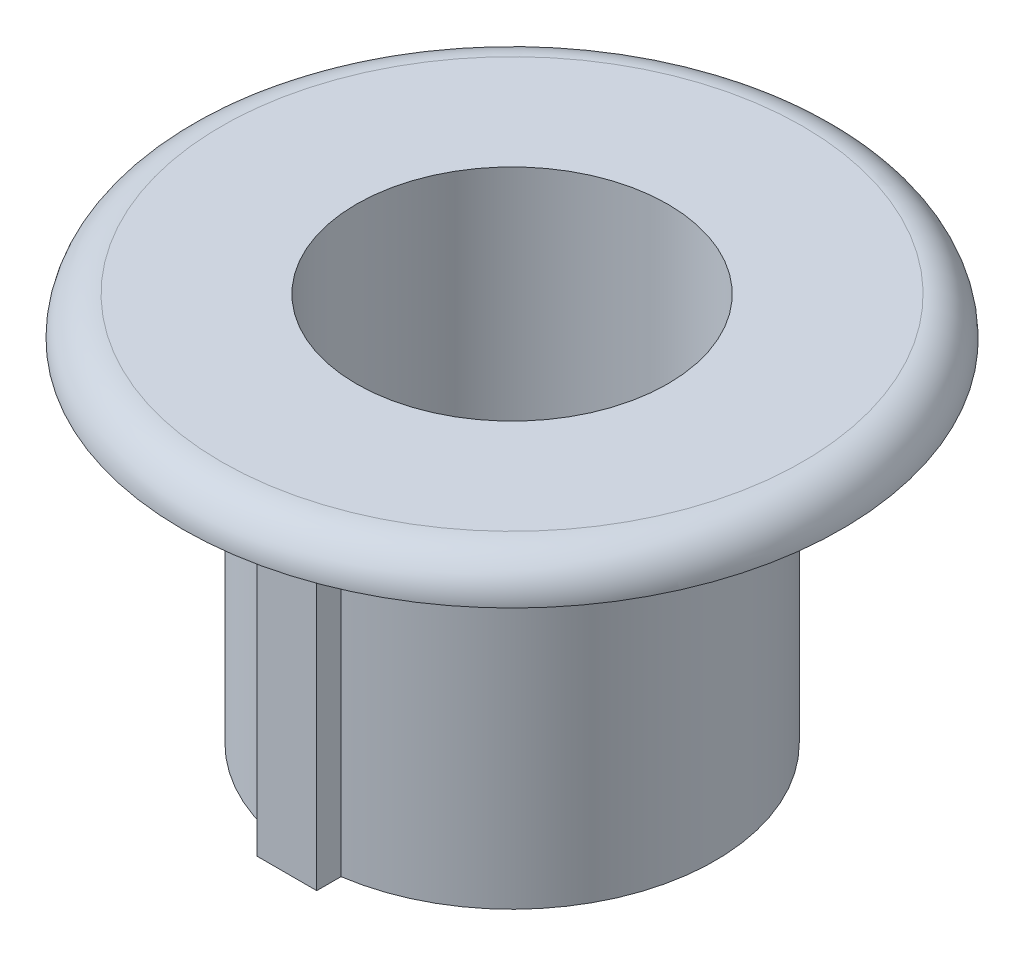
ISO-10303-21;
HEADER;
FILE_DESCRIPTION(('STEP AP214'),'2;1');
FILE_NAME('part.step','',(''),(''),'','','');
FILE_SCHEMA(('AUTOMOTIVE_DESIGN { 1 0 10303 214 1 1 1 1 }'));
ENDSEC;
DATA;
#1=APPLICATION_CONTEXT('core data for automotive mechanical design processes');
#2=APPLICATION_PROTOCOL_DEFINITION('international standard','automotive_design',2000,#1);
#3=PRODUCT_CONTEXT('',#1,'mechanical');
#4=PRODUCT('Part','Part','',(#3));
#5=PRODUCT_RELATED_PRODUCT_CATEGORY('part','',(#4));
#6=PRODUCT_DEFINITION_FORMATION('','',#4);
#7=PRODUCT_DEFINITION_CONTEXT('part definition',#1,'design');
#8=PRODUCT_DEFINITION('design','',#6,#7);
#9=PRODUCT_DEFINITION_SHAPE('','',#8);
#10=(LENGTH_UNIT() NAMED_UNIT(*) SI_UNIT(.MILLI.,.METRE.));
#11=(NAMED_UNIT(*) PLANE_ANGLE_UNIT() SI_UNIT($,.RADIAN.));
#12=(NAMED_UNIT(*) SI_UNIT($,.STERADIAN.) SOLID_ANGLE_UNIT());
#13=UNCERTAINTY_MEASURE_WITH_UNIT(LENGTH_MEASURE(1.E-05),#10,'distance_accuracy_value','');
#14=(GEOMETRIC_REPRESENTATION_CONTEXT(3) GLOBAL_UNCERTAINTY_ASSIGNED_CONTEXT((#13)) GLOBAL_UNIT_ASSIGNED_CONTEXT((#10,
#11,#12)) REPRESENTATION_CONTEXT('',''));
#15=CARTESIAN_POINT('',(0.,0.,0.));
#16=DIRECTION('',(0.,0.,1.));
#17=DIRECTION('',(1.,0.,0.));
#18=AXIS2_PLACEMENT_3D('',#15,#16,#17);
#19=CARTESIAN_POINT('',(9.6266,40.9103228367056,0.));
#20=DIRECTION('',(0.,-1.,0.));
#21=DIRECTION('',(0.,0.,-1.));
#22=AXIS2_PLACEMENT_3D('',#19,#20,#21);
#23=PLANE('',#22);
#24=CARTESIAN_POINT('',(0.,40.9103228367056,0.));
#25=DIRECTION('',(0.,1.,0.));
#26=DIRECTION('',(0.,0.,1.));
#27=AXIS2_PLACEMENT_3D('',#24,#25,#26);
#28=CIRCLE('',#27,9.6266);
#29=CARTESIAN_POINT('',(0.,40.9103228367056,9.6266));
#30=VERTEX_POINT('',#29);
#31=EDGE_CURVE('E130',#30,#30,#28,.T.);
#32=ORIENTED_EDGE('',*,*,#31,.F.);
#33=EDGE_LOOP('',(#32));
#34=FACE_BOUND('',#33,.T.);
#35=DIRECTION('',(-1.,0.,0.));
#36=VECTOR('',#35,1.);
#37=CARTESIAN_POINT('',(-1.16654141252412,40.9103228367056,8.8138));
#38=LINE('',#37,#36);
#39=CARTESIAN_POINT('',(1.16654141252412,40.9103228367056,8.8138));
#40=VERTEX_POINT('',#39);
#41=CARTESIAN_POINT('',(-1.16654141252412,40.9103228367056,8.8138));
#42=VERTEX_POINT('',#41);
#43=EDGE_CURVE('E58',#40,#42,#38,.T.);
#44=ORIENTED_EDGE('',*,*,#43,.F.);
#45=DIRECTION('',(0.,0.,1.));
#46=VECTOR('',#45,1.);
#47=CARTESIAN_POINT('',(1.16654141252412,40.9103228367056,8.8138));
#48=LINE('',#47,#46);
#49=CARTESIAN_POINT('',(1.16654141252412,40.9103228367056,7.86415037832226));
#50=VERTEX_POINT('',#49);
#51=EDGE_CURVE('E111',#50,#40,#48,.T.);
#52=ORIENTED_EDGE('',*,*,#51,.F.);
#53=CARTESIAN_POINT('',(0.,40.9103228367056,0.));
#54=DIRECTION('',(0.,1.,0.));
#55=DIRECTION('',(0.,0.,1.));
#56=AXIS2_PLACEMENT_3D('',#53,#54,#55);
#57=CIRCLE('',#56,7.9502);
#58=CARTESIAN_POINT('',(-1.16654141252412,40.9103228367056,7.86415037832226));
#59=VERTEX_POINT('',#58);
#60=EDGE_CURVE('E128',#50,#59,#57,.T.);
#61=ORIENTED_EDGE('',*,*,#60,.T.);
#62=DIRECTION('',(0.,0.,-1.));
#63=VECTOR('',#62,1.);
#64=CARTESIAN_POINT('',(-1.16654141252412,40.9103228367056,7.86415037832226));
#65=LINE('',#64,#63);
#66=EDGE_CURVE('E63',#42,#59,#65,.T.);
#67=ORIENTED_EDGE('',*,*,#66,.F.);
#68=EDGE_LOOP('',(#44,#52,#61,#67));
#69=FACE_BOUND('',#68,.T.);
#70=ADVANCED_FACE('F43',(#34,#69),#23,.T.);
#71=CARTESIAN_POINT('',(0.,42.4343228367056,0.));
#72=DIRECTION('',(0.,1.,0.));
#73=DIRECTION('',(0.,0.,1.));
#74=AXIS2_PLACEMENT_3D('',#71,#72,#73);
#75=CYLINDRICAL_SURFACE('',#74,7.9502);
#76=ORIENTED_EDGE('',*,*,#60,.F.);
#77=DIRECTION('',(0.,-1.,0.));
#78=VECTOR('',#77,1.);
#79=CARTESIAN_POINT('',(1.16654141252412,43.4292729895447,7.86415037832226));
#80=LINE('',#79,#78);
#81=CARTESIAN_POINT('',(1.16654141252412,27.1943228367056,7.86415037832226));
#82=VERTEX_POINT('',#81);
#83=EDGE_CURVE('E103',#50,#82,#80,.T.);
#84=ORIENTED_EDGE('',*,*,#83,.T.);
#85=CARTESIAN_POINT('',(0.,27.1943228367056,0.));
#86=DIRECTION('',(0.,1.,0.));
#87=DIRECTION('',(0.,0.,1.));
#88=AXIS2_PLACEMENT_3D('',#85,#86,#87);
#89=CIRCLE('',#88,7.9502);
#90=CARTESIAN_POINT('',(-1.16654141252412,27.1943228367056,7.86415037832226));
#91=VERTEX_POINT('',#90);
#92=EDGE_CURVE('E126',#82,#91,#89,.T.);
#93=ORIENTED_EDGE('',*,*,#92,.T.);
#94=DIRECTION('',(0.,-1.,0.));
#95=VECTOR('',#94,1.);
#96=CARTESIAN_POINT('',(-1.16654141252412,43.4292729895447,7.86415037832226));
#97=LINE('',#96,#95);
#98=EDGE_CURVE('E90',#59,#91,#97,.T.);
#99=ORIENTED_EDGE('',*,*,#98,.F.);
#100=EDGE_LOOP('',(#76,#84,#93,#99));
#101=FACE_BOUND('',#100,.T.);
#102=ADVANCED_FACE('F152',(#101),#75,.T.);
#103=CARTESIAN_POINT('',(0.,42.4343228367056,0.));
#104=DIRECTION('',(0.,1.,0.));
#105=DIRECTION('',(0.,0.,1.));
#106=AXIS2_PLACEMENT_3D('',#103,#104,#105);
#107=CYLINDRICAL_SURFACE('',#106,10.414);
#108=CARTESIAN_POINT('',(0.,39.3863228367056,0.));
#109=DIRECTION('',(0.,1.,0.));
#110=DIRECTION('',(0.,0.,1.));
#111=AXIS2_PLACEMENT_3D('',#108,#109,#110);
#112=CIRCLE('',#111,10.414);
#113=CARTESIAN_POINT('',(0.,39.3863228367056,10.414));
#114=VERTEX_POINT('',#113);
#115=EDGE_CURVE('E51',#114,#114,#112,.T.);
#116=ORIENTED_EDGE('',*,*,#115,.T.);
#117=EDGE_LOOP('',(#116));
#118=FACE_BOUND('',#117,.T.);
#119=CARTESIAN_POINT('',(0.,40.9103228367056,0.));
#120=DIRECTION('',(0.,1.,0.));
#121=DIRECTION('',(0.,0.,1.));
#122=AXIS2_PLACEMENT_3D('',#119,#120,#121);
#123=CIRCLE('',#122,10.414);
#124=CARTESIAN_POINT('',(0.,40.9103228367056,10.414));
#125=VERTEX_POINT('',#124);
#126=EDGE_CURVE('E114',#125,#125,#123,.T.);
#127=ORIENTED_EDGE('',*,*,#126,.F.);
#128=EDGE_LOOP('',(#127));
#129=FACE_BOUND('',#128,.T.);
#130=ADVANCED_FACE('F138',(#118,#129),#107,.T.);
#131=CARTESIAN_POINT('',(10.414,39.3863228367056,0.));
#132=DIRECTION('',(0.,-1.,0.));
#133=DIRECTION('',(0.,0.,-1.));
#134=AXIS2_PLACEMENT_3D('',#131,#132,#133);
#135=PLANE('',#134);
#136=CARTESIAN_POINT('',(0.,39.3863228367056,0.));
#137=DIRECTION('',(0.,1.,0.));
#138=DIRECTION('',(0.,0.,1.));
#139=AXIS2_PLACEMENT_3D('',#136,#137,#138);
#140=CIRCLE('',#139,9.6266);
#141=CARTESIAN_POINT('',(0.,39.3863228367056,9.6266));
#142=VERTEX_POINT('',#141);
#143=EDGE_CURVE('E133',#142,#142,#140,.T.);
#144=ORIENTED_EDGE('',*,*,#143,.T.);
#145=EDGE_LOOP('',(#144));
#146=FACE_BOUND('',#145,.T.);
#147=ORIENTED_EDGE('',*,*,#115,.F.);
#148=EDGE_LOOP('',(#147));
#149=FACE_BOUND('',#148,.T.);
#150=ADVANCED_FACE('F141',(#146,#149),#135,.T.);
#151=CARTESIAN_POINT('',(0.,42.4343228367056,0.));
#152=DIRECTION('',(0.,1.,0.));
#153=DIRECTION('',(0.,0.,1.));
#154=AXIS2_PLACEMENT_3D('',#151,#152,#153);
#155=CYLINDRICAL_SURFACE('',#154,9.6266);
#156=ORIENTED_EDGE('',*,*,#31,.T.);
#157=EDGE_LOOP('',(#156));
#158=FACE_BOUND('',#157,.T.);
#159=ORIENTED_EDGE('',*,*,#143,.F.);
#160=EDGE_LOOP('',(#159));
#161=FACE_BOUND('',#160,.T.);
#162=ADVANCED_FACE('F143',(#158,#161),#155,.F.);
#163=CARTESIAN_POINT('',(7.9502,27.1943228367056,0.));
#164=DIRECTION('',(0.,-1.,0.));
#165=DIRECTION('',(0.,0.,-1.));
#166=AXIS2_PLACEMENT_3D('',#163,#164,#165);
#167=PLANE('',#166);
#168=CARTESIAN_POINT('',(0.,27.1943228367056,0.));
#169=DIRECTION('',(0.,1.,0.));
#170=DIRECTION('',(0.,0.,1.));
#171=AXIS2_PLACEMENT_3D('',#168,#169,#170);
#172=CIRCLE('',#171,6.096);
#173=CARTESIAN_POINT('',(0.,27.1943228367056,6.096));
#174=VERTEX_POINT('',#173);
#175=EDGE_CURVE('E123',#174,#174,#172,.T.);
#176=ORIENTED_EDGE('',*,*,#175,.T.);
#177=EDGE_LOOP('',(#176));
#178=FACE_BOUND('',#177,.T.);
#179=ORIENTED_EDGE('',*,*,#92,.F.);
#180=DIRECTION('',(0.,0.,-1.));
#181=VECTOR('',#180,1.);
#182=CARTESIAN_POINT('',(1.16654141252412,27.1943228367056,8.8138));
#183=LINE('',#182,#181);
#184=CARTESIAN_POINT('',(1.16654141252412,27.1943228367056,8.8138));
#185=VERTEX_POINT('',#184);
#186=EDGE_CURVE('E101',#185,#82,#183,.T.);
#187=ORIENTED_EDGE('',*,*,#186,.F.);
#188=DIRECTION('',(1.,0.,0.));
#189=VECTOR('',#188,1.);
#190=CARTESIAN_POINT('',(-1.16654141252412,27.1943228367056,8.8138));
#191=LINE('',#190,#189);
#192=CARTESIAN_POINT('',(-1.16654141252412,27.1943228367056,8.8138));
#193=VERTEX_POINT('',#192);
#194=EDGE_CURVE('E87',#193,#185,#191,.T.);
#195=ORIENTED_EDGE('',*,*,#194,.F.);
#196=DIRECTION('',(0.,0.,1.));
#197=VECTOR('',#196,1.);
#198=CARTESIAN_POINT('',(-1.16654141252412,27.1943228367056,7.86415037832226));
#199=LINE('',#198,#197);
#200=EDGE_CURVE('E95',#91,#193,#199,.T.);
#201=ORIENTED_EDGE('',*,*,#200,.F.);
#202=EDGE_LOOP('',(#179,#187,#195,#201));
#203=FACE_BOUND('',#202,.T.);
#204=ADVANCED_FACE('F99',(#178,#203),#167,.T.);
#205=CARTESIAN_POINT('',(0.,42.4343228367056,0.));
#206=DIRECTION('',(0.,1.,0.));
#207=DIRECTION('',(0.,0.,1.));
#208=AXIS2_PLACEMENT_3D('',#205,#206,#207);
#209=CYLINDRICAL_SURFACE('',#208,6.096);
#210=CARTESIAN_POINT('',(0.,42.4343228367056,0.));
#211=DIRECTION('',(0.,1.,0.));
#212=DIRECTION('',(0.,0.,1.));
#213=AXIS2_PLACEMENT_3D('',#210,#211,#212);
#214=CIRCLE('',#213,6.096);
#215=CARTESIAN_POINT('',(0.,42.4343228367056,6.096));
#216=VERTEX_POINT('',#215);
#217=EDGE_CURVE('E120',#216,#216,#214,.T.);
#218=ORIENTED_EDGE('',*,*,#217,.T.);
#219=EDGE_LOOP('',(#218));
#220=FACE_BOUND('',#219,.T.);
#221=ORIENTED_EDGE('',*,*,#175,.F.);
#222=EDGE_LOOP('',(#221));
#223=FACE_BOUND('',#222,.T.);
#224=ADVANCED_FACE('F165',(#220,#223),#209,.F.);
#225=CARTESIAN_POINT('',(6.096,42.4343228367056,0.));
#226=DIRECTION('',(0.,1.,0.));
#227=DIRECTION('',(0.,0.,1.));
#228=AXIS2_PLACEMENT_3D('',#225,#226,#227);
#229=PLANE('',#228);
#230=CARTESIAN_POINT('',(0.,42.4343228367056,0.));
#231=DIRECTION('',(0.,1.,0.));
#232=DIRECTION('',(0.,0.,1.));
#233=AXIS2_PLACEMENT_3D('',#230,#231,#232);
#234=CIRCLE('',#233,11.3792);
#235=CARTESIAN_POINT('',(0.,42.4343228367056,11.3792));
#236=VERTEX_POINT('',#235);
#237=EDGE_CURVE('E11',#236,#236,#234,.T.);
#238=ORIENTED_EDGE('',*,*,#237,.T.);
#239=EDGE_LOOP('',(#238));
#240=FACE_BOUND('',#239,.T.);
#241=ORIENTED_EDGE('',*,*,#217,.F.);
#242=EDGE_LOOP('',(#241));
#243=FACE_BOUND('',#242,.T.);
#244=ADVANCED_FACE('F169',(#240,#243),#229,.T.);
#245=CARTESIAN_POINT('',(12.9032,40.9103228367056,0.));
#246=DIRECTION('',(0.,-1.,0.));
#247=DIRECTION('',(0.,0.,-1.));
#248=AXIS2_PLACEMENT_3D('',#245,#246,#247);
#249=PLANE('',#248);
#250=ORIENTED_EDGE('',*,*,#126,.T.);
#251=EDGE_LOOP('',(#250));
#252=FACE_BOUND('',#251,.T.);
#253=CARTESIAN_POINT('',(0.,40.9103228367056,0.));
#254=DIRECTION('',(0.,1.,0.));
#255=DIRECTION('',(0.,0.,1.));
#256=AXIS2_PLACEMENT_3D('',#253,#254,#255);
#257=CIRCLE('',#256,12.9032);
#258=CARTESIAN_POINT('',(0.,40.9103228367056,12.9032));
#259=VERTEX_POINT('',#258);
#260=EDGE_CURVE('E117',#259,#259,#257,.T.);
#261=ORIENTED_EDGE('',*,*,#260,.F.);
#262=EDGE_LOOP('',(#261));
#263=FACE_BOUND('',#262,.T.);
#264=ADVANCED_FACE('F173',(#252,#263),#249,.T.);
#265=CARTESIAN_POINT('',(0.,40.9103228367056,0.));
#266=DIRECTION('',(0.,1.,0.));
#267=DIRECTION('',(0.,0.,1.));
#268=AXIS2_PLACEMENT_3D('',#265,#266,#267);
#269=TOROIDAL_SURFACE('',#268,11.3792,1.524);
#270=ORIENTED_EDGE('',*,*,#260,.T.);
#271=EDGE_LOOP('',(#270));
#272=FACE_BOUND('',#271,.T.);
#273=ORIENTED_EDGE('',*,*,#237,.F.);
#274=EDGE_LOOP('',(#273));
#275=FACE_BOUND('',#274,.T.);
#276=ADVANCED_FACE('F45',(#272,#275),#269,.T.);
#277=CARTESIAN_POINT('',(1.16654141252412,43.4292729895447,8.8138));
#278=DIRECTION('',(-1.,0.,0.));
#279=DIRECTION('',(0.,0.,1.));
#280=AXIS2_PLACEMENT_3D('',#277,#278,#279);
#281=PLANE('',#280);
#282=ORIENTED_EDGE('',*,*,#83,.F.);
#283=ORIENTED_EDGE('',*,*,#51,.T.);
#284=DIRECTION('',(0.,-1.,0.));
#285=VECTOR('',#284,1.);
#286=CARTESIAN_POINT('',(1.16654141252412,43.4292729895447,8.8138));
#287=LINE('',#286,#285);
#288=EDGE_CURVE('E91',#40,#185,#287,.T.);
#289=ORIENTED_EDGE('',*,*,#288,.T.);
#290=ORIENTED_EDGE('',*,*,#186,.T.);
#291=EDGE_LOOP('',(#282,#283,#289,#290));
#292=FACE_BOUND('',#291,.T.);
#293=ADVANCED_FACE('F182',(#292),#281,.F.);
#294=CARTESIAN_POINT('',(-1.16654141252412,43.4292729895447,8.8138));
#295=DIRECTION('',(0.,0.,-1.));
#296=DIRECTION('',(-1.,0.,0.));
#297=AXIS2_PLACEMENT_3D('',#294,#295,#296);
#298=PLANE('',#297);
#299=ORIENTED_EDGE('',*,*,#288,.F.);
#300=ORIENTED_EDGE('',*,*,#43,.T.);
#301=DIRECTION('',(0.,-1.,0.));
#302=VECTOR('',#301,1.);
#303=CARTESIAN_POINT('',(-1.16654141252412,43.4292729895447,8.8138));
#304=LINE('',#303,#302);
#305=EDGE_CURVE('E83',#42,#193,#304,.T.);
#306=ORIENTED_EDGE('',*,*,#305,.T.);
#307=ORIENTED_EDGE('',*,*,#194,.T.);
#308=EDGE_LOOP('',(#299,#300,#306,#307));
#309=FACE_BOUND('',#308,.T.);
#310=ADVANCED_FACE('F85',(#309),#298,.F.);
#311=CARTESIAN_POINT('',(-1.16654141252412,43.4292729895447,7.86415037832226));
#312=DIRECTION('',(1.,0.,0.));
#313=DIRECTION('',(0.,0.,-1.));
#314=AXIS2_PLACEMENT_3D('',#311,#312,#313);
#315=PLANE('',#314);
#316=ORIENTED_EDGE('',*,*,#305,.F.);
#317=ORIENTED_EDGE('',*,*,#66,.T.);
#318=ORIENTED_EDGE('',*,*,#98,.T.);
#319=ORIENTED_EDGE('',*,*,#200,.T.);
#320=EDGE_LOOP('',(#316,#317,#318,#319));
#321=FACE_BOUND('',#320,.T.);
#322=ADVANCED_FACE('F96',(#321),#315,.F.);
#323=CLOSED_SHELL('',(#70,#102,#130,#150,#162,#204,#224,#244,#264,#276,#293,#310,#322));
#324=MANIFOLD_SOLID_BREP('B2',#323);
#325=ADVANCED_BREP_SHAPE_REPRESENTATION('',(#18,#324),#14);
#326=SHAPE_DEFINITION_REPRESENTATION(#9,#325);
ENDSEC;
END-ISO-10303-21;
